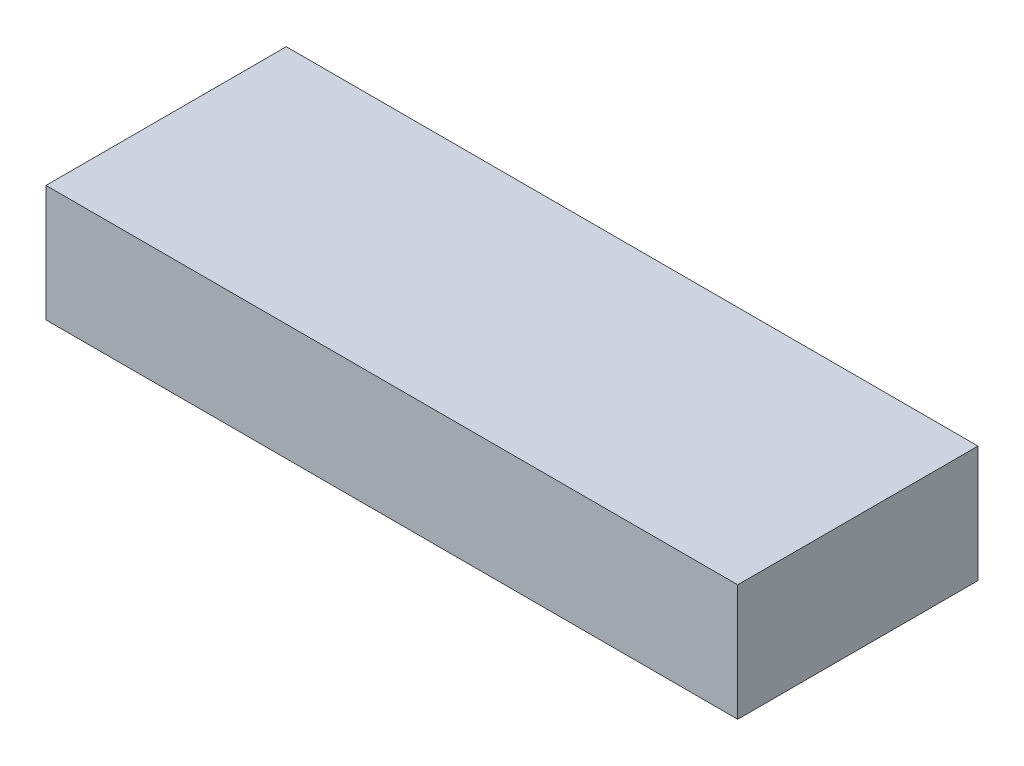
ISO-10303-21;
HEADER;
FILE_DESCRIPTION(('STEP AP214'),'2;1');
FILE_NAME('part.step','',(''),(''),'','','');
FILE_SCHEMA(('AUTOMOTIVE_DESIGN { 1 0 10303 214 1 1 1 1 }'));
ENDSEC;
DATA;
#1=APPLICATION_CONTEXT('core data for automotive mechanical design processes');
#2=APPLICATION_PROTOCOL_DEFINITION('international standard','automotive_design',2000,#1);
#3=PRODUCT_CONTEXT('',#1,'mechanical');
#4=PRODUCT('Part','Part','',(#3));
#5=PRODUCT_RELATED_PRODUCT_CATEGORY('part','',(#4));
#6=PRODUCT_DEFINITION_FORMATION('','',#4);
#7=PRODUCT_DEFINITION_CONTEXT('part definition',#1,'design');
#8=PRODUCT_DEFINITION('design','',#6,#7);
#9=PRODUCT_DEFINITION_SHAPE('','',#8);
#10=(LENGTH_UNIT() NAMED_UNIT(*) SI_UNIT(.MILLI.,.METRE.));
#11=(NAMED_UNIT(*) PLANE_ANGLE_UNIT() SI_UNIT($,.RADIAN.));
#12=(NAMED_UNIT(*) SI_UNIT($,.STERADIAN.) SOLID_ANGLE_UNIT());
#13=UNCERTAINTY_MEASURE_WITH_UNIT(LENGTH_MEASURE(1.E-05),#10,'distance_accuracy_value','');
#14=(GEOMETRIC_REPRESENTATION_CONTEXT(3) GLOBAL_UNCERTAINTY_ASSIGNED_CONTEXT((#13)) GLOBAL_UNIT_ASSIGNED_CONTEXT((#10,
#11,#12)) REPRESENTATION_CONTEXT('',''));
#15=CARTESIAN_POINT('',(0.,0.,0.));
#16=DIRECTION('',(0.,0.,1.));
#17=DIRECTION('',(1.,0.,0.));
#18=AXIS2_PLACEMENT_3D('',#15,#16,#17);
#19=CARTESIAN_POINT('',(23.75,8.,8.25));
#20=DIRECTION('',(-1.,0.,0.));
#21=DIRECTION('',(0.,0.,1.));
#22=AXIS2_PLACEMENT_3D('',#19,#20,#21);
#23=PLANE('',#22);
#24=DIRECTION('',(0.,0.,-1.));
#25=VECTOR('',#24,1.);
#26=CARTESIAN_POINT('',(23.75,0.,8.25));
#27=LINE('',#26,#25);
#28=CARTESIAN_POINT('',(23.75,0.,8.25));
#29=VERTEX_POINT('',#28);
#30=CARTESIAN_POINT('',(23.75,0.,-8.25));
#31=VERTEX_POINT('',#30);
#32=EDGE_CURVE('E111',#29,#31,#27,.T.);
#33=ORIENTED_EDGE('',*,*,#32,.T.);
#34=DIRECTION('',(0.,-1.,0.));
#35=VECTOR('',#34,1.);
#36=CARTESIAN_POINT('',(23.75,8.,-8.25));
#37=LINE('',#36,#35);
#38=CARTESIAN_POINT('',(23.75,8.,-8.25));
#39=VERTEX_POINT('',#38);
#40=EDGE_CURVE('E11',#39,#31,#37,.T.);
#41=ORIENTED_EDGE('',*,*,#40,.F.);
#42=DIRECTION('',(0.,0.,-1.));
#43=VECTOR('',#42,1.);
#44=CARTESIAN_POINT('',(23.75,8.,8.25));
#45=LINE('',#44,#43);
#46=CARTESIAN_POINT('',(23.75,8.,8.25));
#47=VERTEX_POINT('',#46);
#48=EDGE_CURVE('E95',#47,#39,#45,.T.);
#49=ORIENTED_EDGE('',*,*,#48,.F.);
#50=DIRECTION('',(0.,-1.,0.));
#51=VECTOR('',#50,1.);
#52=CARTESIAN_POINT('',(23.75,8.,8.25));
#53=LINE('',#52,#51);
#54=EDGE_CURVE('E107',#47,#29,#53,.T.);
#55=ORIENTED_EDGE('',*,*,#54,.T.);
#56=EDGE_LOOP('',(#33,#41,#49,#55));
#57=FACE_BOUND('',#56,.T.);
#58=ADVANCED_FACE('F43',(#57),#23,.F.);
#59=CARTESIAN_POINT('',(-23.75,8.,-8.25));
#60=DIRECTION('',(0.,0.,1.));
#61=DIRECTION('',(1.,0.,0.));
#62=AXIS2_PLACEMENT_3D('',#59,#60,#61);
#63=PLANE('',#62);
#64=DIRECTION('',(-1.,0.,0.));
#65=VECTOR('',#64,1.);
#66=CARTESIAN_POINT('',(-23.75,0.,-8.25));
#67=LINE('',#66,#65);
#68=CARTESIAN_POINT('',(-23.75,0.,-8.25));
#69=VERTEX_POINT('',#68);
#70=EDGE_CURVE('E100',#31,#69,#67,.T.);
#71=ORIENTED_EDGE('',*,*,#70,.T.);
#72=DIRECTION('',(0.,-1.,0.));
#73=VECTOR('',#72,1.);
#74=CARTESIAN_POINT('',(-23.75,8.,-8.25));
#75=LINE('',#74,#73);
#76=CARTESIAN_POINT('',(-23.75,8.,-8.25));
#77=VERTEX_POINT('',#76);
#78=EDGE_CURVE('E52',#77,#69,#75,.T.);
#79=ORIENTED_EDGE('',*,*,#78,.F.);
#80=DIRECTION('',(-1.,0.,0.));
#81=VECTOR('',#80,1.);
#82=CARTESIAN_POINT('',(-23.75,8.,-8.25));
#83=LINE('',#82,#81);
#84=EDGE_CURVE('E90',#39,#77,#83,.T.);
#85=ORIENTED_EDGE('',*,*,#84,.F.);
#86=ORIENTED_EDGE('',*,*,#40,.T.);
#87=EDGE_LOOP('',(#71,#79,#85,#86));
#88=FACE_BOUND('',#87,.T.);
#89=ADVANCED_FACE('F99',(#88),#63,.F.);
#90=CARTESIAN_POINT('',(-23.75,8.,8.25));
#91=DIRECTION('',(1.,0.,0.));
#92=DIRECTION('',(0.,0.,-1.));
#93=AXIS2_PLACEMENT_3D('',#90,#91,#92);
#94=PLANE('',#93);
#95=DIRECTION('',(0.,0.,1.));
#96=VECTOR('',#95,1.);
#97=CARTESIAN_POINT('',(-23.75,0.,8.25));
#98=LINE('',#97,#96);
#99=CARTESIAN_POINT('',(-23.75,0.,8.25));
#100=VERTEX_POINT('',#99);
#101=EDGE_CURVE('E77',#69,#100,#98,.T.);
#102=ORIENTED_EDGE('',*,*,#101,.T.);
#103=DIRECTION('',(0.,-1.,0.));
#104=VECTOR('',#103,1.);
#105=CARTESIAN_POINT('',(-23.75,8.,8.25));
#106=LINE('',#105,#104);
#107=CARTESIAN_POINT('',(-23.75,8.,8.25));
#108=VERTEX_POINT('',#107);
#109=EDGE_CURVE('E102',#108,#100,#106,.T.);
#110=ORIENTED_EDGE('',*,*,#109,.F.);
#111=DIRECTION('',(0.,0.,1.));
#112=VECTOR('',#111,1.);
#113=CARTESIAN_POINT('',(-23.75,8.,8.25));
#114=LINE('',#113,#112);
#115=EDGE_CURVE('E93',#77,#108,#114,.T.);
#116=ORIENTED_EDGE('',*,*,#115,.F.);
#117=ORIENTED_EDGE('',*,*,#78,.T.);
#118=EDGE_LOOP('',(#102,#110,#116,#117));
#119=FACE_BOUND('',#118,.T.);
#120=ADVANCED_FACE('F103',(#119),#94,.F.);
#121=CARTESIAN_POINT('',(-23.75,8.,8.25));
#122=DIRECTION('',(0.,0.,-1.));
#123=DIRECTION('',(-1.,0.,0.));
#124=AXIS2_PLACEMENT_3D('',#121,#122,#123);
#125=PLANE('',#124);
#126=DIRECTION('',(1.,0.,0.));
#127=VECTOR('',#126,1.);
#128=CARTESIAN_POINT('',(-23.75,0.,8.25));
#129=LINE('',#128,#127);
#130=EDGE_CURVE('E83',#100,#29,#129,.T.);
#131=ORIENTED_EDGE('',*,*,#130,.T.);
#132=ORIENTED_EDGE('',*,*,#54,.F.);
#133=DIRECTION('',(1.,0.,0.));
#134=VECTOR('',#133,1.);
#135=CARTESIAN_POINT('',(-23.75,8.,8.25));
#136=LINE('',#135,#134);
#137=EDGE_CURVE('E60',#108,#47,#136,.T.);
#138=ORIENTED_EDGE('',*,*,#137,.F.);
#139=ORIENTED_EDGE('',*,*,#109,.T.);
#140=EDGE_LOOP('',(#131,#132,#138,#139));
#141=FACE_BOUND('',#140,.T.);
#142=ADVANCED_FACE('F124',(#141),#125,.F.);
#143=CARTESIAN_POINT('',(0.,8.,0.));
#144=DIRECTION('',(0.,-1.,0.));
#145=DIRECTION('',(0.,0.,-1.));
#146=AXIS2_PLACEMENT_3D('',#143,#144,#145);
#147=PLANE('',#146);
#148=ORIENTED_EDGE('',*,*,#48,.T.);
#149=ORIENTED_EDGE('',*,*,#84,.T.);
#150=ORIENTED_EDGE('',*,*,#115,.T.);
#151=ORIENTED_EDGE('',*,*,#137,.T.);
#152=EDGE_LOOP('',(#148,#149,#150,#151));
#153=FACE_BOUND('',#152,.T.);
#154=ADVANCED_FACE('F91',(#153),#147,.F.);
#155=CARTESIAN_POINT('',(0.,0.,0.));
#156=DIRECTION('',(0.,-1.,0.));
#157=DIRECTION('',(0.,0.,-1.));
#158=AXIS2_PLACEMENT_3D('',#155,#156,#157);
#159=PLANE('',#158);
#160=ORIENTED_EDGE('',*,*,#32,.F.);
#161=ORIENTED_EDGE('',*,*,#130,.F.);
#162=ORIENTED_EDGE('',*,*,#101,.F.);
#163=ORIENTED_EDGE('',*,*,#70,.F.);
#164=EDGE_LOOP('',(#160,#161,#162,#163));
#165=FACE_BOUND('',#164,.T.);
#166=ADVANCED_FACE('F127',(#165),#159,.T.);
#167=CLOSED_SHELL('',(#58,#89,#120,#142,#154,#166));
#168=MANIFOLD_SOLID_BREP('B2',#167);
#169=ADVANCED_BREP_SHAPE_REPRESENTATION('',(#18,#168),#14);
#170=SHAPE_DEFINITION_REPRESENTATION(#9,#169);
ENDSEC;
END-ISO-10303-21;
